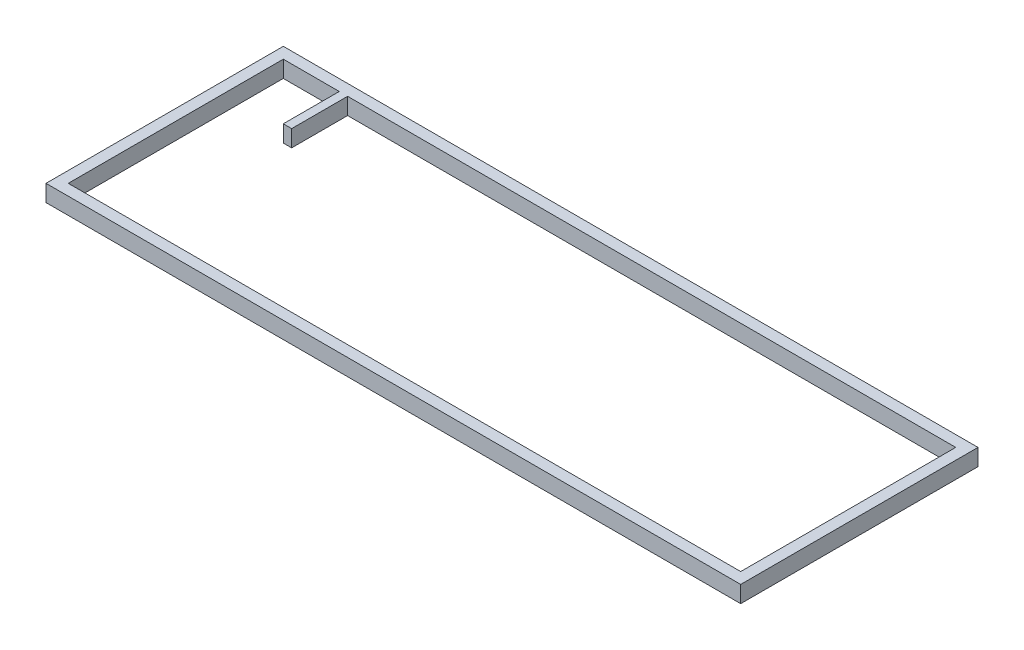
ISO-10303-21;
HEADER;
FILE_DESCRIPTION(('STEP AP214'),'2;1');
FILE_NAME('part.step','',(''),(''),'','','');
FILE_SCHEMA(('AUTOMOTIVE_DESIGN { 1 0 10303 214 1 1 1 1 }'));
ENDSEC;
DATA;
#1=APPLICATION_CONTEXT('core data for automotive mechanical design processes');
#2=APPLICATION_PROTOCOL_DEFINITION('international standard','automotive_design',2000,#1);
#3=PRODUCT_CONTEXT('',#1,'mechanical');
#4=PRODUCT('Part','Part','',(#3));
#5=PRODUCT_RELATED_PRODUCT_CATEGORY('part','',(#4));
#6=PRODUCT_DEFINITION_FORMATION('','',#4);
#7=PRODUCT_DEFINITION_CONTEXT('part definition',#1,'design');
#8=PRODUCT_DEFINITION('design','',#6,#7);
#9=PRODUCT_DEFINITION_SHAPE('','',#8);
#10=(LENGTH_UNIT() NAMED_UNIT(*) SI_UNIT(.MILLI.,.METRE.));
#11=(NAMED_UNIT(*) PLANE_ANGLE_UNIT() SI_UNIT($,.RADIAN.));
#12=(NAMED_UNIT(*) SI_UNIT($,.STERADIAN.) SOLID_ANGLE_UNIT());
#13=UNCERTAINTY_MEASURE_WITH_UNIT(LENGTH_MEASURE(1.E-05),#10,'distance_accuracy_value','');
#14=(GEOMETRIC_REPRESENTATION_CONTEXT(3) GLOBAL_UNCERTAINTY_ASSIGNED_CONTEXT((#13)) GLOBAL_UNIT_ASSIGNED_CONTEXT((#10,
#11,#12)) REPRESENTATION_CONTEXT('',''));
#15=CARTESIAN_POINT('',(0.,0.,0.));
#16=DIRECTION('',(0.,0.,1.));
#17=DIRECTION('',(1.,0.,0.));
#18=AXIS2_PLACEMENT_3D('',#15,#16,#17);
#19=CARTESIAN_POINT('',(0.,6.,0.));
#20=DIRECTION('',(0.,-1.,0.));
#21=DIRECTION('',(0.,0.,-1.));
#22=AXIS2_PLACEMENT_3D('',#19,#20,#21);
#23=PLANE('',#22);
#24=DIRECTION('',(0.,0.,1.));
#25=VECTOR('',#24,1.);
#26=CARTESIAN_POINT('',(0.,6.,0.));
#27=LINE('',#26,#25);
#28=CARTESIAN_POINT('',(0.,6.,-85.25));
#29=VERTEX_POINT('',#28);
#30=CARTESIAN_POINT('',(0.,6.,0.));
#31=VERTEX_POINT('',#30);
#32=EDGE_CURVE('E218',#29,#31,#27,.T.);
#33=ORIENTED_EDGE('',*,*,#32,.T.);
#34=DIRECTION('',(1.,0.,0.));
#35=VECTOR('',#34,1.);
#36=CARTESIAN_POINT('',(0.,6.,0.));
#37=LINE('',#36,#35);
#38=CARTESIAN_POINT('',(249.56,6.,0.));
#39=VERTEX_POINT('',#38);
#40=EDGE_CURVE('E222',#31,#39,#37,.T.);
#41=ORIENTED_EDGE('',*,*,#40,.T.);
#42=DIRECTION('',(0.,0.,-1.));
#43=VECTOR('',#42,1.);
#44=CARTESIAN_POINT('',(249.56,6.,0.));
#45=LINE('',#44,#43);
#46=CARTESIAN_POINT('',(249.56,6.,-85.25));
#47=VERTEX_POINT('',#46);
#48=EDGE_CURVE('E226',#39,#47,#45,.T.);
#49=ORIENTED_EDGE('',*,*,#48,.T.);
#50=DIRECTION('',(-1.,0.,0.));
#51=VECTOR('',#50,1.);
#52=CARTESIAN_POINT('',(0.,6.,-85.25));
#53=LINE('',#52,#51);
#54=EDGE_CURVE('E229',#47,#29,#53,.T.);
#55=ORIENTED_EDGE('',*,*,#54,.T.);
#56=EDGE_LOOP('',(#33,#41,#49,#55));
#57=FACE_BOUND('',#56,.T.);
#58=DIRECTION('',(0.,0.,1.));
#59=VECTOR('',#58,1.);
#60=CARTESIAN_POINT('',(4.,6.,-81.25));
#61=LINE('',#60,#59);
#62=CARTESIAN_POINT('',(4.,6.,-81.25));
#63=VERTEX_POINT('',#62);
#64=CARTESIAN_POINT('',(4.00000000000001,6.,-4.));
#65=VERTEX_POINT('',#64);
#66=EDGE_CURVE('E129',#63,#65,#61,.T.);
#67=ORIENTED_EDGE('',*,*,#66,.F.);
#68=DIRECTION('',(-1.,0.,0.));
#69=VECTOR('',#68,1.);
#70=CARTESIAN_POINT('',(4.,6.,-81.25));
#71=LINE('',#70,#69);
#72=CARTESIAN_POINT('',(24.1,6.,-81.25));
#73=VERTEX_POINT('',#72);
#74=EDGE_CURVE('E170',#73,#63,#71,.T.);
#75=ORIENTED_EDGE('',*,*,#74,.F.);
#76=DIRECTION('',(0.,0.,-1.));
#77=VECTOR('',#76,1.);
#78=CARTESIAN_POINT('',(24.1,6.,-81.25));
#79=LINE('',#78,#77);
#80=CARTESIAN_POINT('',(24.1,6.,-61.15));
#81=VERTEX_POINT('',#80);
#82=EDGE_CURVE('E167',#81,#73,#79,.T.);
#83=ORIENTED_EDGE('',*,*,#82,.F.);
#84=DIRECTION('',(-1.,0.,0.));
#85=VECTOR('',#84,1.);
#86=CARTESIAN_POINT('',(24.1,6.,-61.15));
#87=LINE('',#86,#85);
#88=CARTESIAN_POINT('',(27.1,6.,-61.15));
#89=VERTEX_POINT('',#88);
#90=EDGE_CURVE('E164',#89,#81,#87,.T.);
#91=ORIENTED_EDGE('',*,*,#90,.F.);
#92=DIRECTION('',(0.,0.,1.));
#93=VECTOR('',#92,1.);
#94=CARTESIAN_POINT('',(27.1,6.,-81.25));
#95=LINE('',#94,#93);
#96=CARTESIAN_POINT('',(27.1,6.,-81.25));
#97=VERTEX_POINT('',#96);
#98=EDGE_CURVE('E161',#97,#89,#95,.T.);
#99=ORIENTED_EDGE('',*,*,#98,.F.);
#100=DIRECTION('',(-1.,0.,0.));
#101=VECTOR('',#100,1.);
#102=CARTESIAN_POINT('',(27.1,6.,-81.25));
#103=LINE('',#102,#101);
#104=CARTESIAN_POINT('',(245.56,6.,-81.25));
#105=VERTEX_POINT('',#104);
#106=EDGE_CURVE('E156',#105,#97,#103,.T.);
#107=ORIENTED_EDGE('',*,*,#106,.F.);
#108=DIRECTION('',(0.,0.,-1.));
#109=VECTOR('',#108,1.);
#110=CARTESIAN_POINT('',(245.56,6.,-81.25));
#111=LINE('',#110,#109);
#112=CARTESIAN_POINT('',(245.56,6.,-4.));
#113=VERTEX_POINT('',#112);
#114=EDGE_CURVE('E152',#113,#105,#111,.T.);
#115=ORIENTED_EDGE('',*,*,#114,.F.);
#116=DIRECTION('',(1.,0.,0.));
#117=VECTOR('',#116,1.);
#118=CARTESIAN_POINT('',(4.00000000000001,6.,-4.));
#119=LINE('',#118,#117);
#120=EDGE_CURVE('E138',#65,#113,#119,.T.);
#121=ORIENTED_EDGE('',*,*,#120,.F.);
#122=EDGE_LOOP('',(#67,#75,#83,#91,#99,#107,#115,#121));
#123=FACE_BOUND('',#122,.T.);
#124=ADVANCED_FACE('F39',(#57,#123),#23,.F.);
#125=CARTESIAN_POINT('',(0.,0.,0.));
#126=DIRECTION('',(0.,-1.,0.));
#127=DIRECTION('',(0.,0.,-1.));
#128=AXIS2_PLACEMENT_3D('',#125,#126,#127);
#129=PLANE('',#128);
#130=DIRECTION('',(0.,0.,1.));
#131=VECTOR('',#130,1.);
#132=CARTESIAN_POINT('',(0.,0.,0.));
#133=LINE('',#132,#131);
#134=CARTESIAN_POINT('',(0.,0.,-85.25));
#135=VERTEX_POINT('',#134);
#136=CARTESIAN_POINT('',(0.,0.,0.));
#137=VERTEX_POINT('',#136);
#138=EDGE_CURVE('E147',#135,#137,#133,.T.);
#139=ORIENTED_EDGE('',*,*,#138,.F.);
#140=DIRECTION('',(-1.,0.,0.));
#141=VECTOR('',#140,1.);
#142=CARTESIAN_POINT('',(0.,0.,-85.25));
#143=LINE('',#142,#141);
#144=CARTESIAN_POINT('',(249.56,0.,-85.25));
#145=VERTEX_POINT('',#144);
#146=EDGE_CURVE('E223',#145,#135,#143,.T.);
#147=ORIENTED_EDGE('',*,*,#146,.F.);
#148=DIRECTION('',(0.,0.,-1.));
#149=VECTOR('',#148,1.);
#150=CARTESIAN_POINT('',(249.56,0.,0.));
#151=LINE('',#150,#149);
#152=CARTESIAN_POINT('',(249.56,0.,0.));
#153=VERTEX_POINT('',#152);
#154=EDGE_CURVE('E239',#153,#145,#151,.T.);
#155=ORIENTED_EDGE('',*,*,#154,.F.);
#156=DIRECTION('',(1.,0.,0.));
#157=VECTOR('',#156,1.);
#158=CARTESIAN_POINT('',(0.,0.,0.));
#159=LINE('',#158,#157);
#160=EDGE_CURVE('E236',#137,#153,#159,.T.);
#161=ORIENTED_EDGE('',*,*,#160,.F.);
#162=EDGE_LOOP('',(#139,#147,#155,#161));
#163=FACE_BOUND('',#162,.T.);
#164=DIRECTION('',(-1.,0.,0.));
#165=VECTOR('',#164,1.);
#166=CARTESIAN_POINT('',(4.,0.,-81.25));
#167=LINE('',#166,#165);
#168=CARTESIAN_POINT('',(24.1,0.,-81.25));
#169=VERTEX_POINT('',#168);
#170=CARTESIAN_POINT('',(4.,0.,-81.25));
#171=VERTEX_POINT('',#170);
#172=EDGE_CURVE('E139',#169,#171,#167,.T.);
#173=ORIENTED_EDGE('',*,*,#172,.T.);
#174=DIRECTION('',(0.,0.,1.));
#175=VECTOR('',#174,1.);
#176=CARTESIAN_POINT('',(4.,0.,-81.25));
#177=LINE('',#176,#175);
#178=CARTESIAN_POINT('',(4.00000000000001,0.,-4.));
#179=VERTEX_POINT('',#178);
#180=EDGE_CURVE('E63',#171,#179,#177,.T.);
#181=ORIENTED_EDGE('',*,*,#180,.T.);
#182=DIRECTION('',(1.,0.,0.));
#183=VECTOR('',#182,1.);
#184=CARTESIAN_POINT('',(4.00000000000001,0.,-4.));
#185=LINE('',#184,#183);
#186=CARTESIAN_POINT('',(245.56,0.,-4.));
#187=VERTEX_POINT('',#186);
#188=EDGE_CURVE('E145',#179,#187,#185,.T.);
#189=ORIENTED_EDGE('',*,*,#188,.T.);
#190=DIRECTION('',(0.,0.,-1.));
#191=VECTOR('',#190,1.);
#192=CARTESIAN_POINT('',(245.56,0.,-81.25));
#193=LINE('',#192,#191);
#194=CARTESIAN_POINT('',(245.56,0.,-81.25));
#195=VERTEX_POINT('',#194);
#196=EDGE_CURVE('E177',#187,#195,#193,.T.);
#197=ORIENTED_EDGE('',*,*,#196,.T.);
#198=DIRECTION('',(-1.,0.,0.));
#199=VECTOR('',#198,1.);
#200=CARTESIAN_POINT('',(27.1,0.,-81.25));
#201=LINE('',#200,#199);
#202=CARTESIAN_POINT('',(27.1,0.,-81.25));
#203=VERTEX_POINT('',#202);
#204=EDGE_CURVE('E181',#195,#203,#201,.T.);
#205=ORIENTED_EDGE('',*,*,#204,.T.);
#206=DIRECTION('',(0.,0.,1.));
#207=VECTOR('',#206,1.);
#208=CARTESIAN_POINT('',(27.1,0.,-81.25));
#209=LINE('',#208,#207);
#210=CARTESIAN_POINT('',(27.1,0.,-61.15));
#211=VERTEX_POINT('',#210);
#212=EDGE_CURVE('E185',#203,#211,#209,.T.);
#213=ORIENTED_EDGE('',*,*,#212,.T.);
#214=DIRECTION('',(-1.,0.,0.));
#215=VECTOR('',#214,1.);
#216=CARTESIAN_POINT('',(24.1,0.,-61.15));
#217=LINE('',#216,#215);
#218=CARTESIAN_POINT('',(24.1,0.,-61.15));
#219=VERTEX_POINT('',#218);
#220=EDGE_CURVE('E189',#211,#219,#217,.T.);
#221=ORIENTED_EDGE('',*,*,#220,.T.);
#222=DIRECTION('',(0.,0.,-1.));
#223=VECTOR('',#222,1.);
#224=CARTESIAN_POINT('',(24.1,0.,-81.25));
#225=LINE('',#224,#223);
#226=EDGE_CURVE('E193',#219,#169,#225,.T.);
#227=ORIENTED_EDGE('',*,*,#226,.T.);
#228=EDGE_LOOP('',(#173,#181,#189,#197,#205,#213,#221,#227));
#229=FACE_BOUND('',#228,.T.);
#230=ADVANCED_FACE('F262',(#163,#229),#129,.T.);
#231=CARTESIAN_POINT('',(0.,6.,0.));
#232=DIRECTION('',(1.,0.,0.));
#233=DIRECTION('',(0.,0.,-1.));
#234=AXIS2_PLACEMENT_3D('',#231,#232,#233);
#235=PLANE('',#234);
#236=ORIENTED_EDGE('',*,*,#138,.T.);
#237=DIRECTION('',(0.,-1.,0.));
#238=VECTOR('',#237,1.);
#239=CARTESIAN_POINT('',(0.,6.,0.));
#240=LINE('',#239,#238);
#241=EDGE_CURVE('E11',#31,#137,#240,.T.);
#242=ORIENTED_EDGE('',*,*,#241,.F.);
#243=ORIENTED_EDGE('',*,*,#32,.F.);
#244=DIRECTION('',(0.,-1.,0.));
#245=VECTOR('',#244,1.);
#246=CARTESIAN_POINT('',(0.,6.,-85.25));
#247=LINE('',#246,#245);
#248=EDGE_CURVE('E232',#29,#135,#247,.T.);
#249=ORIENTED_EDGE('',*,*,#248,.T.);
#250=EDGE_LOOP('',(#236,#242,#243,#249));
#251=FACE_BOUND('',#250,.T.);
#252=ADVANCED_FACE('F41',(#251),#235,.F.);
#253=CARTESIAN_POINT('',(0.,6.,0.));
#254=DIRECTION('',(0.,0.,-1.));
#255=DIRECTION('',(-1.,0.,0.));
#256=AXIS2_PLACEMENT_3D('',#253,#254,#255);
#257=PLANE('',#256);
#258=ORIENTED_EDGE('',*,*,#160,.T.);
#259=DIRECTION('',(0.,-1.,0.));
#260=VECTOR('',#259,1.);
#261=CARTESIAN_POINT('',(249.56,6.,0.));
#262=LINE('',#261,#260);
#263=EDGE_CURVE('E48',#39,#153,#262,.T.);
#264=ORIENTED_EDGE('',*,*,#263,.F.);
#265=ORIENTED_EDGE('',*,*,#40,.F.);
#266=ORIENTED_EDGE('',*,*,#241,.T.);
#267=EDGE_LOOP('',(#258,#264,#265,#266));
#268=FACE_BOUND('',#267,.T.);
#269=ADVANCED_FACE('F272',(#268),#257,.F.);
#270=CARTESIAN_POINT('',(249.56,6.,0.));
#271=DIRECTION('',(-1.,0.,0.));
#272=DIRECTION('',(0.,0.,1.));
#273=AXIS2_PLACEMENT_3D('',#270,#271,#272);
#274=PLANE('',#273);
#275=ORIENTED_EDGE('',*,*,#154,.T.);
#276=DIRECTION('',(0.,-1.,0.));
#277=VECTOR('',#276,1.);
#278=CARTESIAN_POINT('',(249.56,6.,-85.25));
#279=LINE('',#278,#277);
#280=EDGE_CURVE('E247',#47,#145,#279,.T.);
#281=ORIENTED_EDGE('',*,*,#280,.F.);
#282=ORIENTED_EDGE('',*,*,#48,.F.);
#283=ORIENTED_EDGE('',*,*,#263,.T.);
#284=EDGE_LOOP('',(#275,#281,#282,#283));
#285=FACE_BOUND('',#284,.T.);
#286=ADVANCED_FACE('F256',(#285),#274,.F.);
#287=CARTESIAN_POINT('',(0.,6.,-85.25));
#288=DIRECTION('',(0.,0.,1.));
#289=DIRECTION('',(1.,0.,0.));
#290=AXIS2_PLACEMENT_3D('',#287,#288,#289);
#291=PLANE('',#290);
#292=ORIENTED_EDGE('',*,*,#146,.T.);
#293=ORIENTED_EDGE('',*,*,#248,.F.);
#294=ORIENTED_EDGE('',*,*,#54,.F.);
#295=ORIENTED_EDGE('',*,*,#280,.T.);
#296=EDGE_LOOP('',(#292,#293,#294,#295));
#297=FACE_BOUND('',#296,.T.);
#298=ADVANCED_FACE('F266',(#297),#291,.F.);
#299=CARTESIAN_POINT('',(4.,6.,-81.25));
#300=DIRECTION('',(1.,0.,0.));
#301=DIRECTION('',(0.,0.,-1.));
#302=AXIS2_PLACEMENT_3D('',#299,#300,#301);
#303=PLANE('',#302);
#304=ORIENTED_EDGE('',*,*,#180,.F.);
#305=DIRECTION('',(0.,-1.,0.));
#306=VECTOR('',#305,1.);
#307=CARTESIAN_POINT('',(4.,6.,-81.25));
#308=LINE('',#307,#306);
#309=EDGE_CURVE('E133',#63,#171,#308,.T.);
#310=ORIENTED_EDGE('',*,*,#309,.F.);
#311=ORIENTED_EDGE('',*,*,#66,.T.);
#312=DIRECTION('',(0.,-1.,0.));
#313=VECTOR('',#312,1.);
#314=CARTESIAN_POINT('',(4.00000000000001,6.,-4.));
#315=LINE('',#314,#313);
#316=EDGE_CURVE('E132',#65,#179,#315,.T.);
#317=ORIENTED_EDGE('',*,*,#316,.T.);
#318=EDGE_LOOP('',(#304,#310,#311,#317));
#319=FACE_BOUND('',#318,.T.);
#320=ADVANCED_FACE('F131',(#319),#303,.T.);
#321=CARTESIAN_POINT('',(4.00000000000001,6.,-4.));
#322=DIRECTION('',(0.,0.,-1.));
#323=DIRECTION('',(-1.,0.,0.));
#324=AXIS2_PLACEMENT_3D('',#321,#322,#323);
#325=PLANE('',#324);
#326=ORIENTED_EDGE('',*,*,#188,.F.);
#327=ORIENTED_EDGE('',*,*,#316,.F.);
#328=ORIENTED_EDGE('',*,*,#120,.T.);
#329=DIRECTION('',(0.,-1.,0.));
#330=VECTOR('',#329,1.);
#331=CARTESIAN_POINT('',(245.56,6.,-4.));
#332=LINE('',#331,#330);
#333=EDGE_CURVE('E148',#113,#187,#332,.T.);
#334=ORIENTED_EDGE('',*,*,#333,.T.);
#335=EDGE_LOOP('',(#326,#327,#328,#334));
#336=FACE_BOUND('',#335,.T.);
#337=ADVANCED_FACE('F142',(#336),#325,.T.);
#338=CARTESIAN_POINT('',(245.56,6.,-81.25));
#339=DIRECTION('',(-1.,0.,0.));
#340=DIRECTION('',(0.,0.,1.));
#341=AXIS2_PLACEMENT_3D('',#338,#339,#340);
#342=PLANE('',#341);
#343=ORIENTED_EDGE('',*,*,#196,.F.);
#344=ORIENTED_EDGE('',*,*,#333,.F.);
#345=ORIENTED_EDGE('',*,*,#114,.T.);
#346=DIRECTION('',(0.,-1.,0.));
#347=VECTOR('',#346,1.);
#348=CARTESIAN_POINT('',(245.56,6.,-81.25));
#349=LINE('',#348,#347);
#350=EDGE_CURVE('E213',#105,#195,#349,.T.);
#351=ORIENTED_EDGE('',*,*,#350,.T.);
#352=EDGE_LOOP('',(#343,#344,#345,#351));
#353=FACE_BOUND('',#352,.T.);
#354=ADVANCED_FACE('F295',(#353),#342,.T.);
#355=CARTESIAN_POINT('',(27.1,6.,-81.25));
#356=DIRECTION('',(0.,0.,1.));
#357=DIRECTION('',(1.,0.,0.));
#358=AXIS2_PLACEMENT_3D('',#355,#356,#357);
#359=PLANE('',#358);
#360=ORIENTED_EDGE('',*,*,#204,.F.);
#361=ORIENTED_EDGE('',*,*,#350,.F.);
#362=ORIENTED_EDGE('',*,*,#106,.T.);
#363=DIRECTION('',(0.,-1.,0.));
#364=VECTOR('',#363,1.);
#365=CARTESIAN_POINT('',(27.1,6.,-81.25));
#366=LINE('',#365,#364);
#367=EDGE_CURVE('E210',#97,#203,#366,.T.);
#368=ORIENTED_EDGE('',*,*,#367,.T.);
#369=EDGE_LOOP('',(#360,#361,#362,#368));
#370=FACE_BOUND('',#369,.T.);
#371=ADVANCED_FACE('F299',(#370),#359,.T.);
#372=CARTESIAN_POINT('',(27.1,6.,-81.25));
#373=DIRECTION('',(1.,0.,0.));
#374=DIRECTION('',(0.,0.,-1.));
#375=AXIS2_PLACEMENT_3D('',#372,#373,#374);
#376=PLANE('',#375);
#377=ORIENTED_EDGE('',*,*,#212,.F.);
#378=ORIENTED_EDGE('',*,*,#367,.F.);
#379=ORIENTED_EDGE('',*,*,#98,.T.);
#380=DIRECTION('',(0.,-1.,0.));
#381=VECTOR('',#380,1.);
#382=CARTESIAN_POINT('',(27.1,6.,-61.15));
#383=LINE('',#382,#381);
#384=EDGE_CURVE('E207',#89,#211,#383,.T.);
#385=ORIENTED_EDGE('',*,*,#384,.T.);
#386=EDGE_LOOP('',(#377,#378,#379,#385));
#387=FACE_BOUND('',#386,.T.);
#388=ADVANCED_FACE('F305',(#387),#376,.T.);
#389=CARTESIAN_POINT('',(24.1,6.,-61.15));
#390=DIRECTION('',(0.,0.,1.));
#391=DIRECTION('',(1.,0.,0.));
#392=AXIS2_PLACEMENT_3D('',#389,#390,#391);
#393=PLANE('',#392);
#394=ORIENTED_EDGE('',*,*,#220,.F.);
#395=ORIENTED_EDGE('',*,*,#384,.F.);
#396=ORIENTED_EDGE('',*,*,#90,.T.);
#397=DIRECTION('',(0.,-1.,0.));
#398=VECTOR('',#397,1.);
#399=CARTESIAN_POINT('',(24.1,6.,-61.15));
#400=LINE('',#399,#398);
#401=EDGE_CURVE('E204',#81,#219,#400,.T.);
#402=ORIENTED_EDGE('',*,*,#401,.T.);
#403=EDGE_LOOP('',(#394,#395,#396,#402));
#404=FACE_BOUND('',#403,.T.);
#405=ADVANCED_FACE('F309',(#404),#393,.T.);
#406=CARTESIAN_POINT('',(24.1,6.,-81.25));
#407=DIRECTION('',(-1.,0.,0.));
#408=DIRECTION('',(0.,0.,1.));
#409=AXIS2_PLACEMENT_3D('',#406,#407,#408);
#410=PLANE('',#409);
#411=ORIENTED_EDGE('',*,*,#226,.F.);
#412=ORIENTED_EDGE('',*,*,#401,.F.);
#413=ORIENTED_EDGE('',*,*,#82,.T.);
#414=DIRECTION('',(0.,-1.,0.));
#415=VECTOR('',#414,1.);
#416=CARTESIAN_POINT('',(24.1,6.,-81.25));
#417=LINE('',#416,#415);
#418=EDGE_CURVE('E55',#73,#169,#417,.T.);
#419=ORIENTED_EDGE('',*,*,#418,.T.);
#420=EDGE_LOOP('',(#411,#412,#413,#419));
#421=FACE_BOUND('',#420,.T.);
#422=ADVANCED_FACE('F313',(#421),#410,.T.);
#423=CARTESIAN_POINT('',(4.,6.,-81.25));
#424=DIRECTION('',(0.,0.,1.));
#425=DIRECTION('',(1.,0.,0.));
#426=AXIS2_PLACEMENT_3D('',#423,#424,#425);
#427=PLANE('',#426);
#428=ORIENTED_EDGE('',*,*,#172,.F.);
#429=ORIENTED_EDGE('',*,*,#418,.F.);
#430=ORIENTED_EDGE('',*,*,#74,.T.);
#431=ORIENTED_EDGE('',*,*,#309,.T.);
#432=EDGE_LOOP('',(#428,#429,#430,#431));
#433=FACE_BOUND('',#432,.T.);
#434=ADVANCED_FACE('F317',(#433),#427,.T.);
#435=CLOSED_SHELL('',(#124,#230,#252,#269,#286,#298,#320,#337,#354,#371,#388,#405,#422,#434));
#436=MANIFOLD_SOLID_BREP('B2',#435);
#437=ADVANCED_BREP_SHAPE_REPRESENTATION('',(#18,#436),#14);
#438=SHAPE_DEFINITION_REPRESENTATION(#9,#437);
ENDSEC;
END-ISO-10303-21;
